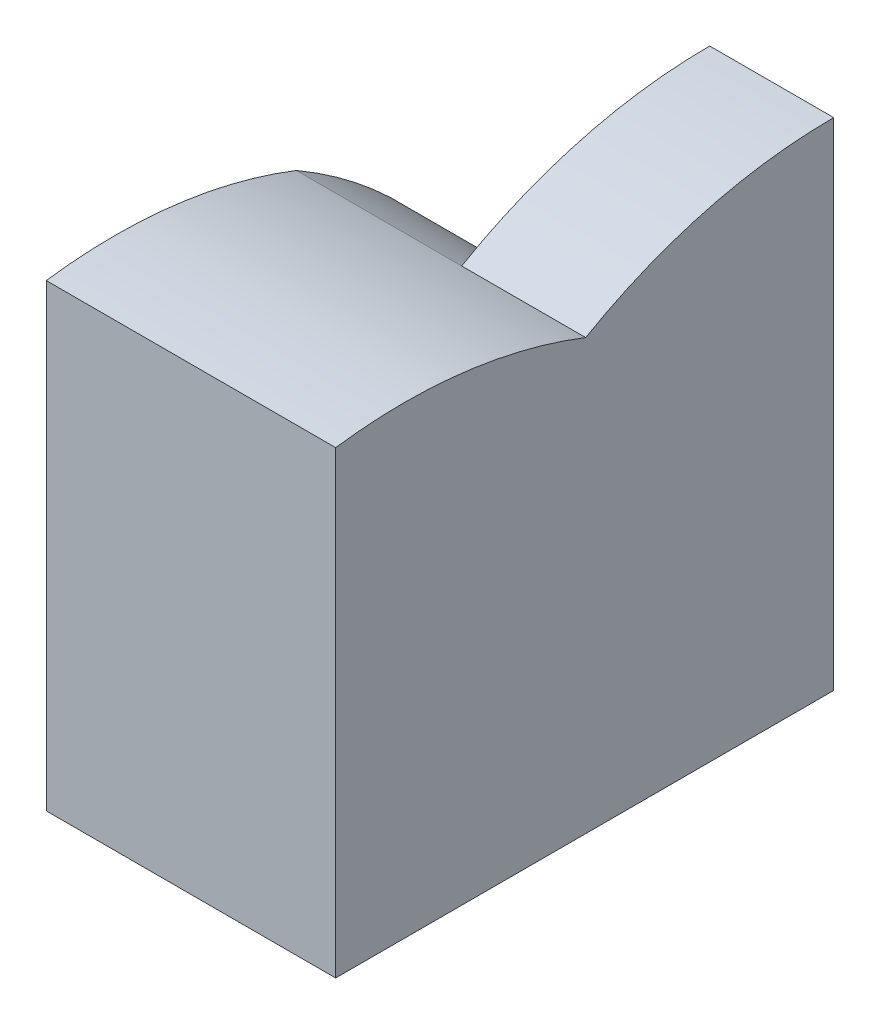
ISO-10303-21;
HEADER;
FILE_DESCRIPTION(('STEP AP214'),'2;1');
FILE_NAME('part.step','',(''),(''),'','','');
FILE_SCHEMA(('AUTOMOTIVE_DESIGN { 1 0 10303 214 1 1 1 1 }'));
ENDSEC;
DATA;
#1=APPLICATION_CONTEXT('core data for automotive mechanical design processes');
#2=APPLICATION_PROTOCOL_DEFINITION('international standard','automotive_design',2000,#1);
#3=PRODUCT_CONTEXT('',#1,'mechanical');
#4=PRODUCT('Part','Part','',(#3));
#5=PRODUCT_RELATED_PRODUCT_CATEGORY('part','',(#4));
#6=PRODUCT_DEFINITION_FORMATION('','',#4);
#7=PRODUCT_DEFINITION_CONTEXT('part definition',#1,'design');
#8=PRODUCT_DEFINITION('design','',#6,#7);
#9=PRODUCT_DEFINITION_SHAPE('','',#8);
#10=(LENGTH_UNIT() NAMED_UNIT(*) SI_UNIT(.MILLI.,.METRE.));
#11=(NAMED_UNIT(*) PLANE_ANGLE_UNIT() SI_UNIT($,.RADIAN.));
#12=(NAMED_UNIT(*) SI_UNIT($,.STERADIAN.) SOLID_ANGLE_UNIT());
#13=UNCERTAINTY_MEASURE_WITH_UNIT(LENGTH_MEASURE(1.E-05),#10,'distance_accuracy_value','');
#14=(GEOMETRIC_REPRESENTATION_CONTEXT(3) GLOBAL_UNCERTAINTY_ASSIGNED_CONTEXT((#13)) GLOBAL_UNIT_ASSIGNED_CONTEXT((#10,
#11,#12)) REPRESENTATION_CONTEXT('',''));
#15=CARTESIAN_POINT('',(0.,0.,0.));
#16=DIRECTION('',(0.,0.,1.));
#17=DIRECTION('',(1.,0.,0.));
#18=AXIS2_PLACEMENT_3D('',#15,#16,#17);
#19=CARTESIAN_POINT('',(-1.5,0.,0.));
#20=DIRECTION('',(1.,0.,0.));
#21=DIRECTION('',(0.,0.,-1.));
#22=AXIS2_PLACEMENT_3D('',#19,#20,#21);
#23=PLANE('',#22);
#24=CARTESIAN_POINT('',(-1.5,0.,6.));
#25=DIRECTION('',(1.,0.,0.));
#26=DIRECTION('',(0.,0.,-1.));
#27=AXIS2_PLACEMENT_3D('',#24,#25,#26);
#28=CIRCLE('',#27,6.);
#29=CARTESIAN_POINT('',(-1.5,5.19615242270663,3.));
#30=VERTEX_POINT('',#29);
#31=CARTESIAN_POINT('',(-1.5,0.,0.));
#32=VERTEX_POINT('',#31);
#33=EDGE_CURVE('E103',#30,#32,#28,.F.);
#34=ORIENTED_EDGE('',*,*,#33,.F.);
#35=CARTESIAN_POINT('',(-1.5,0.,0.));
#36=DIRECTION('',(1.,0.,0.));
#37=DIRECTION('',(0.,0.,-1.));
#38=AXIS2_PLACEMENT_3D('',#35,#36,#37);
#39=CIRCLE('',#38,6.00000000000001);
#40=CARTESIAN_POINT('',(-1.5,6.,0.));
#41=VERTEX_POINT('',#40);
#42=EDGE_CURVE('E54',#30,#41,#39,.F.);
#43=ORIENTED_EDGE('',*,*,#42,.T.);
#44=DIRECTION('',(0.,1.,0.));
#45=VECTOR('',#44,1.);
#46=CARTESIAN_POINT('',(-1.5,0.,0.));
#47=LINE('',#46,#45);
#48=EDGE_CURVE('E100',#32,#41,#47,.T.);
#49=ORIENTED_EDGE('',*,*,#48,.F.);
#50=EDGE_LOOP('',(#34,#43,#49));
#51=FACE_BOUND('',#50,.T.);
#52=ADVANCED_FACE('F35',(#51),#23,.F.);
#53=CARTESIAN_POINT('',(-1.5,0.,0.));
#54=DIRECTION('',(1.,0.,0.));
#55=DIRECTION('',(0.,0.,-1.));
#56=AXIS2_PLACEMENT_3D('',#53,#54,#55);
#57=CYLINDRICAL_SURFACE('',#56,6.00000000000001);
#58=CARTESIAN_POINT('',(0.,0.,0.));
#59=DIRECTION('',(1.,0.,0.));
#60=DIRECTION('',(0.,0.,-1.));
#61=AXIS2_PLACEMENT_3D('',#58,#59,#60);
#62=CIRCLE('',#61,6.00000000000001);
#63=CARTESIAN_POINT('',(0.,5.19615242270663,3.));
#64=VERTEX_POINT('',#63);
#65=CARTESIAN_POINT('',(0.,6.,0.));
#66=VERTEX_POINT('',#65);
#67=EDGE_CURVE('E116',#64,#66,#62,.F.);
#68=ORIENTED_EDGE('',*,*,#67,.T.);
#69=DIRECTION('',(1.,0.,0.));
#70=VECTOR('',#69,1.);
#71=CARTESIAN_POINT('',(-1.5,6.,0.));
#72=LINE('',#71,#70);
#73=EDGE_CURVE('E11',#41,#66,#72,.T.);
#74=ORIENTED_EDGE('',*,*,#73,.F.);
#75=ORIENTED_EDGE('',*,*,#42,.F.);
#76=DIRECTION('',(1.,0.,0.));
#77=VECTOR('',#76,1.);
#78=CARTESIAN_POINT('',(-1.5,5.19615242270663,3.));
#79=LINE('',#78,#77);
#80=EDGE_CURVE('E88',#30,#64,#79,.T.);
#81=ORIENTED_EDGE('',*,*,#80,.T.);
#82=EDGE_LOOP('',(#68,#74,#75,#81));
#83=FACE_BOUND('',#82,.T.);
#84=ADVANCED_FACE('F37',(#83),#57,.T.);
#85=CARTESIAN_POINT('',(-1.5,0.,0.));
#86=DIRECTION('',(0.,0.,-1.));
#87=DIRECTION('',(-1.,0.,0.));
#88=AXIS2_PLACEMENT_3D('',#85,#86,#87);
#89=PLANE('',#88);
#90=DIRECTION('',(0.,1.,0.));
#91=VECTOR('',#90,1.);
#92=CARTESIAN_POINT('',(0.,0.,0.));
#93=LINE('',#92,#91);
#94=CARTESIAN_POINT('',(0.,0.,0.));
#95=VERTEX_POINT('',#94);
#96=EDGE_CURVE('E108',#95,#66,#93,.T.);
#97=ORIENTED_EDGE('',*,*,#96,.F.);
#98=DIRECTION('',(1.,0.,0.));
#99=VECTOR('',#98,1.);
#100=CARTESIAN_POINT('',(-1.5,0.,0.));
#101=LINE('',#100,#99);
#102=EDGE_CURVE('E45',#32,#95,#101,.T.);
#103=ORIENTED_EDGE('',*,*,#102,.F.);
#104=ORIENTED_EDGE('',*,*,#48,.T.);
#105=ORIENTED_EDGE('',*,*,#73,.T.);
#106=EDGE_LOOP('',(#97,#103,#104,#105));
#107=FACE_BOUND('',#106,.T.);
#108=ADVANCED_FACE('F132',(#107),#89,.T.);
#109=CARTESIAN_POINT('',(-1.5,0.,0.));
#110=DIRECTION('',(0.,-1.,0.));
#111=DIRECTION('',(0.,0.,-1.));
#112=AXIS2_PLACEMENT_3D('',#109,#110,#111);
#113=PLANE('',#112);
#114=ORIENTED_EDGE('',*,*,#102,.T.);
#115=DIRECTION('',(0.,0.,-1.));
#116=VECTOR('',#115,1.);
#117=CARTESIAN_POINT('',(0.,0.,0.));
#118=LINE('',#117,#116);
#119=CARTESIAN_POINT('',(0.,0.,6.02358690290006));
#120=VERTEX_POINT('',#119);
#121=EDGE_CURVE('E67',#120,#95,#118,.T.);
#122=ORIENTED_EDGE('',*,*,#121,.F.);
#123=DIRECTION('',(1.,0.,0.));
#124=VECTOR('',#123,1.);
#125=CARTESIAN_POINT('',(-3.5,0.,6.02358690290006));
#126=LINE('',#125,#124);
#127=CARTESIAN_POINT('',(-3.5,0.,6.02358690290006));
#128=VERTEX_POINT('',#127);
#129=EDGE_CURVE('E113',#128,#120,#126,.T.);
#130=ORIENTED_EDGE('',*,*,#129,.F.);
#131=DIRECTION('',(0.,0.,-1.));
#132=VECTOR('',#131,1.);
#133=CARTESIAN_POINT('',(-3.5,0.,3.));
#134=LINE('',#133,#132);
#135=CARTESIAN_POINT('',(-3.5,0.,0.));
#136=VERTEX_POINT('',#135);
#137=EDGE_CURVE('E76',#128,#136,#134,.T.);
#138=ORIENTED_EDGE('',*,*,#137,.T.);
#139=DIRECTION('',(-1.,0.,0.));
#140=VECTOR('',#139,1.);
#141=CARTESIAN_POINT('',(0.,0.,0.));
#142=LINE('',#141,#140);
#143=EDGE_CURVE('E106',#32,#136,#142,.T.);
#144=ORIENTED_EDGE('',*,*,#143,.F.);
#145=EDGE_LOOP('',(#114,#122,#130,#138,#144));
#146=FACE_BOUND('',#145,.T.);
#147=ADVANCED_FACE('F129',(#146),#113,.T.);
#148=CARTESIAN_POINT('',(0.,0.,0.));
#149=DIRECTION('',(1.,0.,0.));
#150=DIRECTION('',(0.,0.,-1.));
#151=AXIS2_PLACEMENT_3D('',#148,#149,#150);
#152=PLANE('',#151);
#153=ORIENTED_EDGE('',*,*,#67,.F.);
#154=CARTESIAN_POINT('',(0.,-0.38763504670582,5.19574987109928));
#155=DIRECTION('',(-1.,0.,0.));
#156=DIRECTION('',(0.,0.,-1.));
#157=AXIS2_PLACEMENT_3D('',#154,#155,#156);
#158=CIRCLE('',#157,6.);
#159=CARTESIAN_POINT('',(0.,5.55498103114906,6.02358690290006));
#160=VERTEX_POINT('',#159);
#161=EDGE_CURVE('E96',#160,#64,#158,.T.);
#162=ORIENTED_EDGE('',*,*,#161,.F.);
#163=DIRECTION('',(0.,1.,0.));
#164=VECTOR('',#163,1.);
#165=CARTESIAN_POINT('',(0.,0.,6.02358690290006));
#166=LINE('',#165,#164);
#167=EDGE_CURVE('E135',#120,#160,#166,.T.);
#168=ORIENTED_EDGE('',*,*,#167,.F.);
#169=ORIENTED_EDGE('',*,*,#121,.T.);
#170=ORIENTED_EDGE('',*,*,#96,.T.);
#171=EDGE_LOOP('',(#153,#162,#168,#169,#170));
#172=FACE_BOUND('',#171,.T.);
#173=ADVANCED_FACE('F133',(#172),#152,.T.);
#174=CARTESIAN_POINT('',(-3.5,-0.0135554604858055,0.0236022154620173));
#175=DIRECTION('',(-1.,0.,0.));
#176=DIRECTION('',(0.,0.,1.));
#177=AXIS2_PLACEMENT_3D('',#174,#175,#176);
#178=PLANE('',#177);
#179=CARTESIAN_POINT('',(-3.5,0.,6.));
#180=DIRECTION('',(-1.,0.,0.));
#181=DIRECTION('',(0.,0.,1.));
#182=AXIS2_PLACEMENT_3D('',#179,#180,#181);
#183=CIRCLE('',#182,6.);
#184=CARTESIAN_POINT('',(-3.5,5.19615242270663,3.));
#185=VERTEX_POINT('',#184);
#186=EDGE_CURVE('E112',#136,#185,#183,.F.);
#187=ORIENTED_EDGE('',*,*,#186,.F.);
#188=ORIENTED_EDGE('',*,*,#137,.F.);
#189=DIRECTION('',(0.,1.,0.));
#190=VECTOR('',#189,1.);
#191=CARTESIAN_POINT('',(-3.5,0.,6.02358690290006));
#192=LINE('',#191,#190);
#193=CARTESIAN_POINT('',(-3.5,5.55498103114906,6.02358690290006));
#194=VERTEX_POINT('',#193);
#195=EDGE_CURVE('E146',#128,#194,#192,.T.);
#196=ORIENTED_EDGE('',*,*,#195,.T.);
#197=CARTESIAN_POINT('',(-3.5,-0.38763504670582,5.19574987109928));
#198=DIRECTION('',(-1.,0.,0.));
#199=DIRECTION('',(0.,0.,-1.));
#200=AXIS2_PLACEMENT_3D('',#197,#198,#199);
#201=CIRCLE('',#200,6.);
#202=EDGE_CURVE('E144',#194,#185,#201,.T.);
#203=ORIENTED_EDGE('',*,*,#202,.T.);
#204=EDGE_LOOP('',(#187,#188,#196,#203));
#205=FACE_BOUND('',#204,.T.);
#206=ADVANCED_FACE('F156',(#205),#178,.T.);
#207=CARTESIAN_POINT('',(0.,0.,6.));
#208=DIRECTION('',(-1.,0.,0.));
#209=DIRECTION('',(0.,0.,1.));
#210=AXIS2_PLACEMENT_3D('',#207,#208,#209);
#211=CYLINDRICAL_SURFACE('',#210,6.);
#212=DIRECTION('',(1.,0.,0.));
#213=VECTOR('',#212,1.);
#214=CARTESIAN_POINT('',(-3.5,5.19615242270663,3.));
#215=LINE('',#214,#213);
#216=EDGE_CURVE('E92',#185,#30,#215,.T.);
#217=ORIENTED_EDGE('',*,*,#216,.T.);
#218=ORIENTED_EDGE('',*,*,#33,.T.);
#219=ORIENTED_EDGE('',*,*,#143,.T.);
#220=ORIENTED_EDGE('',*,*,#186,.T.);
#221=EDGE_LOOP('',(#217,#218,#219,#220));
#222=FACE_BOUND('',#221,.T.);
#223=ADVANCED_FACE('F110',(#222),#211,.T.);
#224=CARTESIAN_POINT('',(0.,-0.38763504670582,5.19574987109928));
#225=DIRECTION('',(-1.,0.,0.));
#226=DIRECTION('',(0.,0.,1.));
#227=AXIS2_PLACEMENT_3D('',#224,#225,#226);
#228=CYLINDRICAL_SURFACE('',#227,6.);
#229=ORIENTED_EDGE('',*,*,#202,.F.);
#230=DIRECTION('',(-1.,0.,0.));
#231=VECTOR('',#230,1.);
#232=CARTESIAN_POINT('',(0.,5.55498103114906,6.02358690290006));
#233=LINE('',#232,#231);
#234=EDGE_CURVE('E137',#160,#194,#233,.T.);
#235=ORIENTED_EDGE('',*,*,#234,.F.);
#236=ORIENTED_EDGE('',*,*,#161,.T.);
#237=ORIENTED_EDGE('',*,*,#80,.F.);
#238=ORIENTED_EDGE('',*,*,#216,.F.);
#239=EDGE_LOOP('',(#229,#235,#236,#237,#238));
#240=FACE_BOUND('',#239,.T.);
#241=ADVANCED_FACE('F90',(#240),#228,.T.);
#242=CARTESIAN_POINT('',(0.,0.,6.02358690290006));
#243=DIRECTION('',(0.,0.,1.));
#244=DIRECTION('',(1.,0.,0.));
#245=AXIS2_PLACEMENT_3D('',#242,#243,#244);
#246=PLANE('',#245);
#247=ORIENTED_EDGE('',*,*,#195,.F.);
#248=ORIENTED_EDGE('',*,*,#129,.T.);
#249=ORIENTED_EDGE('',*,*,#167,.T.);
#250=ORIENTED_EDGE('',*,*,#234,.T.);
#251=EDGE_LOOP('',(#247,#248,#249,#250));
#252=FACE_BOUND('',#251,.T.);
#253=ADVANCED_FACE('F142',(#252),#246,.T.);
#254=CLOSED_SHELL('',(#52,#84,#108,#147,#173,#206,#223,#241,#253));
#255=MANIFOLD_SOLID_BREP('B2',#254);
#256=ADVANCED_BREP_SHAPE_REPRESENTATION('',(#18,#255),#14);
#257=SHAPE_DEFINITION_REPRESENTATION(#9,#256);
ENDSEC;
END-ISO-10303-21;
